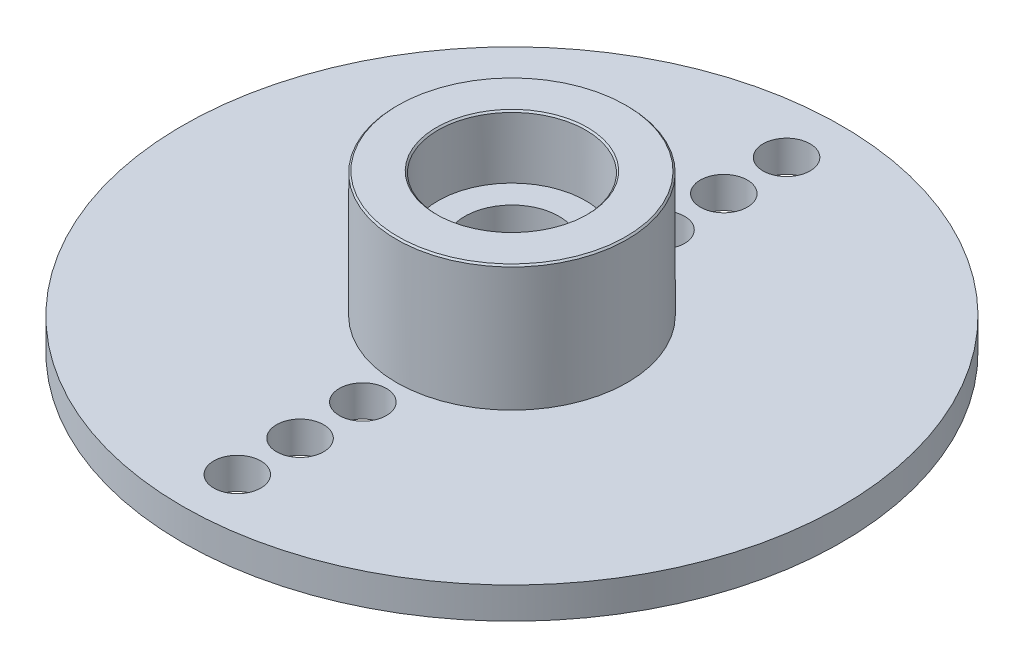
ISO-10303-21;
HEADER;
FILE_DESCRIPTION(('STEP AP214'),'2;1');
FILE_NAME('part.step','',(''),(''),'','','');
FILE_SCHEMA(('AUTOMOTIVE_DESIGN { 1 0 10303 214 1 1 1 1 }'));
ENDSEC;
DATA;
#1=APPLICATION_CONTEXT('core data for automotive mechanical design processes');
#2=APPLICATION_PROTOCOL_DEFINITION('international standard','automotive_design',2000,#1);
#3=PRODUCT_CONTEXT('',#1,'mechanical');
#4=PRODUCT('Part','Part','',(#3));
#5=PRODUCT_RELATED_PRODUCT_CATEGORY('part','',(#4));
#6=PRODUCT_DEFINITION_FORMATION('','',#4);
#7=PRODUCT_DEFINITION_CONTEXT('part definition',#1,'design');
#8=PRODUCT_DEFINITION('design','',#6,#7);
#9=PRODUCT_DEFINITION_SHAPE('','',#8);
#10=(LENGTH_UNIT() NAMED_UNIT(*) SI_UNIT(.MILLI.,.METRE.));
#11=(NAMED_UNIT(*) PLANE_ANGLE_UNIT() SI_UNIT($,.RADIAN.));
#12=(NAMED_UNIT(*) SI_UNIT($,.STERADIAN.) SOLID_ANGLE_UNIT());
#13=UNCERTAINTY_MEASURE_WITH_UNIT(LENGTH_MEASURE(1.E-05),#10,'distance_accuracy_value','');
#14=(GEOMETRIC_REPRESENTATION_CONTEXT(3) GLOBAL_UNCERTAINTY_ASSIGNED_CONTEXT((#13)) GLOBAL_UNIT_ASSIGNED_CONTEXT((#10,
#11,#12)) REPRESENTATION_CONTEXT('',''));
#15=CARTESIAN_POINT('',(0.,0.,0.));
#16=DIRECTION('',(0.,0.,1.));
#17=DIRECTION('',(1.,0.,0.));
#18=AXIS2_PLACEMENT_3D('',#15,#16,#17);
#19=CARTESIAN_POINT('',(0.,5.,0.));
#20=DIRECTION('',(0.,-1.,0.));
#21=DIRECTION('',(0.,0.,-1.));
#22=AXIS2_PLACEMENT_3D('',#19,#20,#21);
#23=CYLINDRICAL_SURFACE('',#22,1.5);
#24=CARTESIAN_POINT('',(0.,1.,0.));
#25=DIRECTION('',(0.,1.,0.));
#26=DIRECTION('',(0.,0.,1.));
#27=AXIS2_PLACEMENT_3D('',#24,#25,#26);
#28=CIRCLE('',#27,1.5);
#29=CARTESIAN_POINT('',(0.,1.,1.5));
#30=VERTEX_POINT('',#29);
#31=EDGE_CURVE('E109',#30,#30,#28,.T.);
#32=ORIENTED_EDGE('',*,*,#31,.F.);
#33=EDGE_LOOP('',(#32));
#34=FACE_BOUND('',#33,.T.);
#35=CARTESIAN_POINT('',(0.,3.,0.));
#36=DIRECTION('',(0.,1.,0.));
#37=DIRECTION('',(0.,0.,1.));
#38=AXIS2_PLACEMENT_3D('',#35,#36,#37);
#39=CIRCLE('',#38,1.5);
#40=CARTESIAN_POINT('',(0.,3.,1.5));
#41=VERTEX_POINT('',#40);
#42=EDGE_CURVE('E70',#41,#41,#39,.F.);
#43=ORIENTED_EDGE('',*,*,#42,.F.);
#44=EDGE_LOOP('',(#43));
#45=FACE_BOUND('',#44,.T.);
#46=ADVANCED_FACE('F45',(#34,#45),#23,.F.);
#47=CARTESIAN_POINT('',(0.,1.,0.));
#48=DIRECTION('',(0.,1.,0.));
#49=DIRECTION('',(0.,0.,1.));
#50=AXIS2_PLACEMENT_3D('',#47,#48,#49);
#51=PLANE('',#50);
#52=CARTESIAN_POINT('',(0.,1.,0.));
#53=DIRECTION('',(0.,1.,0.));
#54=DIRECTION('',(0.,0.,1.));
#55=AXIS2_PLACEMENT_3D('',#52,#53,#54);
#56=CIRCLE('',#55,0.75);
#57=CARTESIAN_POINT('',(0.,1.,0.75));
#58=VERTEX_POINT('',#57);
#59=EDGE_CURVE('E79',#58,#58,#56,.F.);
#60=ORIENTED_EDGE('',*,*,#59,.T.);
#61=EDGE_LOOP('',(#60));
#62=FACE_BOUND('',#61,.T.);
#63=ORIENTED_EDGE('',*,*,#31,.T.);
#64=EDGE_LOOP('',(#63));
#65=FACE_BOUND('',#64,.T.);
#66=ADVANCED_FACE('F174',(#62,#65),#51,.T.);
#67=CARTESIAN_POINT('',(1.11016832917263E-13,1.,6.74999999999998));
#68=DIRECTION('',(0.,-1.,0.));
#69=DIRECTION('',(0.,0.,-1.));
#70=AXIS2_PLACEMENT_3D('',#67,#68,#69);
#71=CYLINDRICAL_SURFACE('',#70,0.75);
#72=CARTESIAN_POINT('',(1.11016832917263E-13,1.,6.74999999999998));
#73=DIRECTION('',(0.,1.,0.));
#74=DIRECTION('',(0.,0.,1.));
#75=AXIS2_PLACEMENT_3D('',#72,#73,#74);
#76=CIRCLE('',#75,0.75);
#77=CARTESIAN_POINT('',(1.11016832917263E-13,1.,7.49999999999998));
#78=VERTEX_POINT('',#77);
#79=EDGE_CURVE('E114',#78,#78,#76,.F.);
#80=ORIENTED_EDGE('',*,*,#79,.F.);
#81=EDGE_LOOP('',(#80));
#82=FACE_BOUND('',#81,.T.);
#83=CARTESIAN_POINT('',(1.11016832917263E-13,0.,6.74999999999998));
#84=DIRECTION('',(0.,1.,0.));
#85=DIRECTION('',(0.,0.,1.));
#86=AXIS2_PLACEMENT_3D('',#83,#84,#85);
#87=CIRCLE('',#86,0.75);
#88=CARTESIAN_POINT('',(1.11016832917263E-13,0.,7.49999999999998));
#89=VERTEX_POINT('',#88);
#90=EDGE_CURVE('E85',#89,#89,#87,.F.);
#91=ORIENTED_EDGE('',*,*,#90,.T.);
#92=EDGE_LOOP('',(#91));
#93=FACE_BOUND('',#92,.T.);
#94=ADVANCED_FACE('F180',(#82,#93),#71,.F.);
#95=CARTESIAN_POINT('',(0.,1.,-8.74999999999998));
#96=DIRECTION('',(0.,-1.,0.));
#97=DIRECTION('',(0.,0.,-1.));
#98=AXIS2_PLACEMENT_3D('',#95,#96,#97);
#99=CYLINDRICAL_SURFACE('',#98,0.75);
#100=CARTESIAN_POINT('',(0.,1.,-8.74999999999998));
#101=DIRECTION('',(0.,1.,0.));
#102=DIRECTION('',(0.,0.,1.));
#103=AXIS2_PLACEMENT_3D('',#100,#101,#102);
#104=CIRCLE('',#103,0.75);
#105=CARTESIAN_POINT('',(0.,1.,-7.99999999999998));
#106=VERTEX_POINT('',#105);
#107=EDGE_CURVE('E118',#106,#106,#104,.T.);
#108=ORIENTED_EDGE('',*,*,#107,.T.);
#109=EDGE_LOOP('',(#108));
#110=FACE_BOUND('',#109,.T.);
#111=CARTESIAN_POINT('',(0.,0.,-8.74999999999998));
#112=DIRECTION('',(0.,1.,0.));
#113=DIRECTION('',(0.,0.,1.));
#114=AXIS2_PLACEMENT_3D('',#111,#112,#113);
#115=CIRCLE('',#114,0.75);
#116=CARTESIAN_POINT('',(0.,0.,-7.99999999999998));
#117=VERTEX_POINT('',#116);
#118=EDGE_CURVE('E89',#117,#117,#115,.T.);
#119=ORIENTED_EDGE('',*,*,#118,.F.);
#120=EDGE_LOOP('',(#119));
#121=FACE_BOUND('',#120,.T.);
#122=ADVANCED_FACE('F210',(#110,#121),#99,.F.);
#123=CARTESIAN_POINT('',(1.11016832917263E-13,1.,-6.74999999999998));
#124=DIRECTION('',(0.,-1.,0.));
#125=DIRECTION('',(0.,0.,-1.));
#126=AXIS2_PLACEMENT_3D('',#123,#124,#125);
#127=CYLINDRICAL_SURFACE('',#126,0.75);
#128=CARTESIAN_POINT('',(1.11016832917263E-13,1.,-6.74999999999998));
#129=DIRECTION('',(0.,1.,0.));
#130=DIRECTION('',(0.,0.,1.));
#131=AXIS2_PLACEMENT_3D('',#128,#129,#130);
#132=CIRCLE('',#131,0.75);
#133=CARTESIAN_POINT('',(1.11016832917263E-13,1.,-5.99999999999998));
#134=VERTEX_POINT('',#133);
#135=EDGE_CURVE('E122',#134,#134,#132,.T.);
#136=ORIENTED_EDGE('',*,*,#135,.T.);
#137=EDGE_LOOP('',(#136));
#138=FACE_BOUND('',#137,.T.);
#139=CARTESIAN_POINT('',(1.11016832917263E-13,0.,-6.74999999999998));
#140=DIRECTION('',(0.,1.,0.));
#141=DIRECTION('',(0.,0.,1.));
#142=AXIS2_PLACEMENT_3D('',#139,#140,#141);
#143=CIRCLE('',#142,0.75);
#144=CARTESIAN_POINT('',(1.11016832917263E-13,0.,-5.99999999999998));
#145=VERTEX_POINT('',#144);
#146=EDGE_CURVE('E93',#145,#145,#143,.T.);
#147=ORIENTED_EDGE('',*,*,#146,.F.);
#148=EDGE_LOOP('',(#147));
#149=FACE_BOUND('',#148,.T.);
#150=ADVANCED_FACE('F214',(#138,#149),#127,.F.);
#151=CARTESIAN_POINT('',(1.35518434629123E-13,1.,-4.74999999999998));
#152=DIRECTION('',(0.,-1.,0.));
#153=DIRECTION('',(0.,0.,-1.));
#154=AXIS2_PLACEMENT_3D('',#151,#152,#153);
#155=CYLINDRICAL_SURFACE('',#154,0.75);
#156=CARTESIAN_POINT('',(1.35518434629123E-13,1.,-4.74999999999998));
#157=DIRECTION('',(0.,1.,0.));
#158=DIRECTION('',(0.,0.,1.));
#159=AXIS2_PLACEMENT_3D('',#156,#157,#158);
#160=CIRCLE('',#159,0.75);
#161=CARTESIAN_POINT('',(1.35518434629123E-13,1.,-3.99999999999998));
#162=VERTEX_POINT('',#161);
#163=EDGE_CURVE('E126',#162,#162,#160,.T.);
#164=ORIENTED_EDGE('',*,*,#163,.T.);
#165=EDGE_LOOP('',(#164));
#166=FACE_BOUND('',#165,.T.);
#167=CARTESIAN_POINT('',(1.35518434629123E-13,0.,-4.74999999999998));
#168=DIRECTION('',(0.,1.,0.));
#169=DIRECTION('',(0.,0.,1.));
#170=AXIS2_PLACEMENT_3D('',#167,#168,#169);
#171=CIRCLE('',#170,0.75);
#172=CARTESIAN_POINT('',(1.35518434629123E-13,0.,-3.99999999999998));
#173=VERTEX_POINT('',#172);
#174=EDGE_CURVE('E97',#173,#173,#171,.T.);
#175=ORIENTED_EDGE('',*,*,#174,.F.);
#176=EDGE_LOOP('',(#175));
#177=FACE_BOUND('',#176,.T.);
#178=ADVANCED_FACE('F218',(#166,#177),#155,.F.);
#179=CARTESIAN_POINT('',(1.35518434629123E-13,1.,4.74999999999998));
#180=DIRECTION('',(0.,-1.,0.));
#181=DIRECTION('',(0.,0.,-1.));
#182=AXIS2_PLACEMENT_3D('',#179,#180,#181);
#183=CYLINDRICAL_SURFACE('',#182,0.75);
#184=CARTESIAN_POINT('',(1.35518434629123E-13,1.,4.74999999999998));
#185=DIRECTION('',(0.,1.,0.));
#186=DIRECTION('',(0.,0.,1.));
#187=AXIS2_PLACEMENT_3D('',#184,#185,#186);
#188=CIRCLE('',#187,0.75);
#189=CARTESIAN_POINT('',(1.35518434629123E-13,1.,5.49999999999998));
#190=VERTEX_POINT('',#189);
#191=EDGE_CURVE('E130',#190,#190,#188,.F.);
#192=ORIENTED_EDGE('',*,*,#191,.F.);
#193=EDGE_LOOP('',(#192));
#194=FACE_BOUND('',#193,.T.);
#195=CARTESIAN_POINT('',(1.35518434629123E-13,0.,4.74999999999998));
#196=DIRECTION('',(0.,1.,0.));
#197=DIRECTION('',(0.,0.,1.));
#198=AXIS2_PLACEMENT_3D('',#195,#196,#197);
#199=CIRCLE('',#198,0.75);
#200=CARTESIAN_POINT('',(1.35518434629123E-13,0.,5.49999999999998));
#201=VERTEX_POINT('',#200);
#202=EDGE_CURVE('E101',#201,#201,#199,.F.);
#203=ORIENTED_EDGE('',*,*,#202,.T.);
#204=EDGE_LOOP('',(#203));
#205=FACE_BOUND('',#204,.T.);
#206=ADVANCED_FACE('F222',(#194,#205),#183,.F.);
#207=CARTESIAN_POINT('',(0.,1.,8.74999999999998));
#208=DIRECTION('',(0.,-1.,0.));
#209=DIRECTION('',(0.,0.,-1.));
#210=AXIS2_PLACEMENT_3D('',#207,#208,#209);
#211=CYLINDRICAL_SURFACE('',#210,0.75);
#212=CARTESIAN_POINT('',(0.,1.,8.74999999999998));
#213=DIRECTION('',(0.,1.,0.));
#214=DIRECTION('',(0.,0.,1.));
#215=AXIS2_PLACEMENT_3D('',#212,#213,#214);
#216=CIRCLE('',#215,0.75);
#217=CARTESIAN_POINT('',(0.,1.,9.49999999999998));
#218=VERTEX_POINT('',#217);
#219=EDGE_CURVE('E84',#218,#218,#216,.F.);
#220=ORIENTED_EDGE('',*,*,#219,.F.);
#221=EDGE_LOOP('',(#220));
#222=FACE_BOUND('',#221,.T.);
#223=CARTESIAN_POINT('',(0.,0.,8.74999999999998));
#224=DIRECTION('',(0.,1.,0.));
#225=DIRECTION('',(0.,0.,1.));
#226=AXIS2_PLACEMENT_3D('',#223,#224,#225);
#227=CIRCLE('',#226,0.75);
#228=CARTESIAN_POINT('',(0.,0.,9.49999999999998));
#229=VERTEX_POINT('',#228);
#230=EDGE_CURVE('E105',#229,#229,#227,.F.);
#231=ORIENTED_EDGE('',*,*,#230,.T.);
#232=EDGE_LOOP('',(#231));
#233=FACE_BOUND('',#232,.T.);
#234=ADVANCED_FACE('F206',(#222,#233),#211,.F.);
#235=CARTESIAN_POINT('',(0.,1.,0.));
#236=DIRECTION('',(0.,-1.,0.));
#237=DIRECTION('',(0.,0.,-1.));
#238=AXIS2_PLACEMENT_3D('',#235,#236,#237);
#239=CYLINDRICAL_SURFACE('',#238,10.5);
#240=CARTESIAN_POINT('',(0.,1.,0.));
#241=DIRECTION('',(0.,1.,0.));
#242=DIRECTION('',(0.,0.,1.));
#243=AXIS2_PLACEMENT_3D('',#240,#241,#242);
#244=CIRCLE('',#243,10.5);
#245=CARTESIAN_POINT('',(0.,1.,10.5));
#246=VERTEX_POINT('',#245);
#247=EDGE_CURVE('E110',#246,#246,#244,.T.);
#248=ORIENTED_EDGE('',*,*,#247,.F.);
#249=EDGE_LOOP('',(#248));
#250=FACE_BOUND('',#249,.T.);
#251=CARTESIAN_POINT('',(0.,0.,0.));
#252=DIRECTION('',(0.,1.,0.));
#253=DIRECTION('',(0.,0.,1.));
#254=AXIS2_PLACEMENT_3D('',#251,#252,#253);
#255=CIRCLE('',#254,10.5);
#256=CARTESIAN_POINT('',(0.,0.,10.5));
#257=VERTEX_POINT('',#256);
#258=EDGE_CURVE('E80',#257,#257,#255,.T.);
#259=ORIENTED_EDGE('',*,*,#258,.T.);
#260=EDGE_LOOP('',(#259));
#261=FACE_BOUND('',#260,.T.);
#262=ADVANCED_FACE('F199',(#250,#261),#239,.T.);
#263=CARTESIAN_POINT('',(0.,1.,0.));
#264=DIRECTION('',(0.,1.,0.));
#265=DIRECTION('',(0.,0.,1.));
#266=AXIS2_PLACEMENT_3D('',#263,#264,#265);
#267=CIRCLE('',#266,3.67931811974818);
#268=CARTESIAN_POINT('',(0.,1.,3.67931811974818));
#269=VERTEX_POINT('',#268);
#270=EDGE_CURVE('E69',#269,#269,#267,.T.);
#271=ORIENTED_EDGE('',*,*,#270,.F.);
#272=EDGE_LOOP('',(#271));
#273=FACE_BOUND('',#272,.T.);
#274=ORIENTED_EDGE('',*,*,#219,.T.);
#275=EDGE_LOOP('',(#274));
#276=FACE_BOUND('',#275,.T.);
#277=ORIENTED_EDGE('',*,*,#191,.T.);
#278=EDGE_LOOP('',(#277));
#279=FACE_BOUND('',#278,.T.);
#280=ORIENTED_EDGE('',*,*,#163,.F.);
#281=EDGE_LOOP('',(#280));
#282=FACE_BOUND('',#281,.T.);
#283=ORIENTED_EDGE('',*,*,#135,.F.);
#284=EDGE_LOOP('',(#283));
#285=FACE_BOUND('',#284,.T.);
#286=ORIENTED_EDGE('',*,*,#107,.F.);
#287=EDGE_LOOP('',(#286));
#288=FACE_BOUND('',#287,.T.);
#289=ORIENTED_EDGE('',*,*,#79,.T.);
#290=EDGE_LOOP('',(#289));
#291=FACE_BOUND('',#290,.T.);
#292=ORIENTED_EDGE('',*,*,#247,.T.);
#293=EDGE_LOOP('',(#292));
#294=FACE_BOUND('',#293,.T.);
#295=ADVANCED_FACE('F183',(#273,#276,#279,#282,#285,#288,#291,#294),#51,.T.);
#296=CARTESIAN_POINT('',(0.,0.,0.));
#297=DIRECTION('',(0.,1.,0.));
#298=DIRECTION('',(0.,0.,1.));
#299=AXIS2_PLACEMENT_3D('',#296,#297,#298);
#300=PLANE('',#299);
#301=CARTESIAN_POINT('',(0.,0.,0.));
#302=DIRECTION('',(0.,-1.,0.));
#303=DIRECTION('',(0.,0.,-1.));
#304=AXIS2_PLACEMENT_3D('',#301,#302,#303);
#305=CIRCLE('',#304,1.5);
#306=CARTESIAN_POINT('',(0.,0.,-1.5));
#307=VERTEX_POINT('',#306);
#308=EDGE_CURVE('E144',#307,#307,#305,.T.);
#309=ORIENTED_EDGE('',*,*,#308,.F.);
#310=EDGE_LOOP('',(#309));
#311=FACE_BOUND('',#310,.T.);
#312=ORIENTED_EDGE('',*,*,#230,.F.);
#313=EDGE_LOOP('',(#312));
#314=FACE_BOUND('',#313,.T.);
#315=ORIENTED_EDGE('',*,*,#202,.F.);
#316=EDGE_LOOP('',(#315));
#317=FACE_BOUND('',#316,.T.);
#318=ORIENTED_EDGE('',*,*,#174,.T.);
#319=EDGE_LOOP('',(#318));
#320=FACE_BOUND('',#319,.T.);
#321=ORIENTED_EDGE('',*,*,#146,.T.);
#322=EDGE_LOOP('',(#321));
#323=FACE_BOUND('',#322,.T.);
#324=ORIENTED_EDGE('',*,*,#118,.T.);
#325=EDGE_LOOP('',(#324));
#326=FACE_BOUND('',#325,.T.);
#327=ORIENTED_EDGE('',*,*,#90,.F.);
#328=EDGE_LOOP('',(#327));
#329=FACE_BOUND('',#328,.T.);
#330=ORIENTED_EDGE('',*,*,#258,.F.);
#331=EDGE_LOOP('',(#330));
#332=FACE_BOUND('',#331,.T.);
#333=ADVANCED_FACE('F195',(#311,#314,#317,#320,#323,#326,#329,#332),#300,.F.);
#334=CARTESIAN_POINT('',(0.,5.,0.));
#335=DIRECTION('',(0.,-1.,0.));
#336=DIRECTION('',(0.,0.,-1.));
#337=AXIS2_PLACEMENT_3D('',#334,#335,#336);
#338=CYLINDRICAL_SURFACE('',#337,3.67931811974818);
#339=CARTESIAN_POINT('',(0.,4.95,0.));
#340=DIRECTION('',(0.,-1.,0.));
#341=DIRECTION('',(0.,0.,-1.));
#342=AXIS2_PLACEMENT_3D('',#339,#340,#341);
#343=CIRCLE('',#342,3.67931811974818);
#344=CARTESIAN_POINT('',(0.,4.95,-3.67931811974818));
#345=VERTEX_POINT('',#344);
#346=EDGE_CURVE('E63',#345,#345,#343,.T.);
#347=ORIENTED_EDGE('',*,*,#346,.T.);
#348=EDGE_LOOP('',(#347));
#349=FACE_BOUND('',#348,.T.);
#350=ORIENTED_EDGE('',*,*,#270,.T.);
#351=EDGE_LOOP('',(#350));
#352=FACE_BOUND('',#351,.T.);
#353=ADVANCED_FACE('F193',(#349,#352),#338,.T.);
#354=CARTESIAN_POINT('',(0.,5.,0.));
#355=DIRECTION('',(0.,-1.,0.));
#356=DIRECTION('',(0.,0.,-1.));
#357=AXIS2_PLACEMENT_3D('',#354,#355,#356);
#358=PLANE('',#357);
#359=CARTESIAN_POINT('',(0.,5.,0.));
#360=DIRECTION('',(0.,-1.,0.));
#361=DIRECTION('',(0.,0.,-1.));
#362=AXIS2_PLACEMENT_3D('',#359,#360,#361);
#363=CIRCLE('',#362,3.62931811974818);
#364=CARTESIAN_POINT('',(0.,5.,-3.62931811974818));
#365=VERTEX_POINT('',#364);
#366=EDGE_CURVE('E53',#365,#365,#363,.F.);
#367=ORIENTED_EDGE('',*,*,#366,.T.);
#368=EDGE_LOOP('',(#367));
#369=FACE_BOUND('',#368,.T.);
#370=CARTESIAN_POINT('',(0.,5.,0.));
#371=DIRECTION('',(0.,-1.,0.));
#372=DIRECTION('',(0.,0.,-1.));
#373=AXIS2_PLACEMENT_3D('',#370,#371,#372);
#374=CIRCLE('',#373,2.405);
#375=CARTESIAN_POINT('',(0.,5.,-2.405));
#376=VERTEX_POINT('',#375);
#377=EDGE_CURVE('E58',#376,#376,#374,.T.);
#378=ORIENTED_EDGE('',*,*,#377,.T.);
#379=EDGE_LOOP('',(#378));
#380=FACE_BOUND('',#379,.T.);
#381=ADVANCED_FACE('F190',(#369,#380),#358,.F.);
#382=CARTESIAN_POINT('',(0.,0.5,0.));
#383=DIRECTION('',(0.,-1.,0.));
#384=DIRECTION('',(0.,0.,-1.));
#385=AXIS2_PLACEMENT_3D('',#382,#383,#384);
#386=CYLINDRICAL_SURFACE('',#385,1.5);
#387=CARTESIAN_POINT('',(0.,0.5,0.));
#388=DIRECTION('',(0.,-1.,0.));
#389=DIRECTION('',(0.,0.,-1.));
#390=AXIS2_PLACEMENT_3D('',#387,#388,#389);
#391=CIRCLE('',#390,1.5);
#392=CARTESIAN_POINT('',(0.,0.5,-1.5));
#393=VERTEX_POINT('',#392);
#394=EDGE_CURVE('E143',#393,#393,#391,.T.);
#395=ORIENTED_EDGE('',*,*,#394,.F.);
#396=EDGE_LOOP('',(#395));
#397=FACE_BOUND('',#396,.T.);
#398=ORIENTED_EDGE('',*,*,#308,.T.);
#399=EDGE_LOOP('',(#398));
#400=FACE_BOUND('',#399,.T.);
#401=ADVANCED_FACE('F188',(#397,#400),#386,.F.);
#402=CARTESIAN_POINT('',(0.,0.5,0.));
#403=DIRECTION('',(0.,-1.,0.));
#404=DIRECTION('',(0.,0.,-1.));
#405=AXIS2_PLACEMENT_3D('',#402,#403,#404);
#406=PLANE('',#405);
#407=CARTESIAN_POINT('',(0.,0.5,0.));
#408=DIRECTION('',(0.,-1.,0.));
#409=DIRECTION('',(0.,0.,-1.));
#410=AXIS2_PLACEMENT_3D('',#407,#408,#409);
#411=CIRCLE('',#410,0.75);
#412=CARTESIAN_POINT('',(0.,0.5,-0.75));
#413=VERTEX_POINT('',#412);
#414=EDGE_CURVE('E74',#413,#413,#411,.F.);
#415=ORIENTED_EDGE('',*,*,#414,.T.);
#416=EDGE_LOOP('',(#415));
#417=FACE_BOUND('',#416,.T.);
#418=ORIENTED_EDGE('',*,*,#394,.T.);
#419=EDGE_LOOP('',(#418));
#420=FACE_BOUND('',#419,.T.);
#421=ADVANCED_FACE('F295',(#417,#420),#406,.T.);
#422=CARTESIAN_POINT('',(0.,5.,0.));
#423=DIRECTION('',(0.,-1.,0.));
#424=DIRECTION('',(0.,0.,-1.));
#425=AXIS2_PLACEMENT_3D('',#422,#423,#424);
#426=CYLINDRICAL_SURFACE('',#425,0.75);
#427=ORIENTED_EDGE('',*,*,#59,.F.);
#428=EDGE_LOOP('',(#427));
#429=FACE_BOUND('',#428,.T.);
#430=ORIENTED_EDGE('',*,*,#414,.F.);
#431=EDGE_LOOP('',(#430));
#432=FACE_BOUND('',#431,.T.);
#433=ADVANCED_FACE('F170',(#429,#432),#426,.F.);
#434=CARTESIAN_POINT('',(0.,3.,0.));
#435=DIRECTION('',(0.,1.,0.));
#436=DIRECTION('',(0.,0.,1.));
#437=AXIS2_PLACEMENT_3D('',#434,#435,#436);
#438=PLANE('',#437);
#439=CARTESIAN_POINT('',(0.,3.,0.));
#440=DIRECTION('',(0.,1.,0.));
#441=DIRECTION('',(0.,0.,1.));
#442=AXIS2_PLACEMENT_3D('',#439,#440,#441);
#443=CIRCLE('',#442,2.355);
#444=CARTESIAN_POINT('',(0.,3.,2.355));
#445=VERTEX_POINT('',#444);
#446=EDGE_CURVE('E75',#445,#445,#443,.T.);
#447=ORIENTED_EDGE('',*,*,#446,.T.);
#448=EDGE_LOOP('',(#447));
#449=FACE_BOUND('',#448,.T.);
#450=ORIENTED_EDGE('',*,*,#42,.T.);
#451=EDGE_LOOP('',(#450));
#452=FACE_BOUND('',#451,.T.);
#453=ADVANCED_FACE('F158',(#449,#452),#438,.T.);
#454=CARTESIAN_POINT('',(0.,3.,0.));
#455=DIRECTION('',(0.,1.,0.));
#456=DIRECTION('',(0.,0.,1.));
#457=AXIS2_PLACEMENT_3D('',#454,#455,#456);
#458=CYLINDRICAL_SURFACE('',#457,2.355);
#459=CARTESIAN_POINT('',(0.,4.95,0.));
#460=DIRECTION('',(0.,-1.,0.));
#461=DIRECTION('',(0.,0.,-1.));
#462=AXIS2_PLACEMENT_3D('',#459,#460,#461);
#463=CIRCLE('',#462,2.355);
#464=CARTESIAN_POINT('',(0.,4.95,-2.355));
#465=VERTEX_POINT('',#464);
#466=EDGE_CURVE('E11',#465,#465,#463,.F.);
#467=ORIENTED_EDGE('',*,*,#466,.T.);
#468=EDGE_LOOP('',(#467));
#469=FACE_BOUND('',#468,.T.);
#470=ORIENTED_EDGE('',*,*,#446,.F.);
#471=EDGE_LOOP('',(#470));
#472=FACE_BOUND('',#471,.T.);
#473=ADVANCED_FACE('F161',(#469,#472),#458,.F.);
#474=CARTESIAN_POINT('',(0.,4.95,0.));
#475=DIRECTION('',(0.,-1.,0.));
#476=DIRECTION('',(0.,0.,-1.));
#477=AXIS2_PLACEMENT_3D('',#474,#475,#476);
#478=CONICAL_SURFACE('',#477,3.67931811974818,0.785398163397457);
#479=ORIENTED_EDGE('',*,*,#366,.F.);
#480=EDGE_LOOP('',(#479));
#481=FACE_BOUND('',#480,.T.);
#482=ORIENTED_EDGE('',*,*,#346,.F.);
#483=EDGE_LOOP('',(#482));
#484=FACE_BOUND('',#483,.T.);
#485=ADVANCED_FACE('F163',(#481,#484),#478,.T.);
#486=CARTESIAN_POINT('',(0.,4.95,0.));
#487=DIRECTION('',(0.,1.,0.));
#488=DIRECTION('',(0.,0.,1.));
#489=AXIS2_PLACEMENT_3D('',#486,#487,#488);
#490=CONICAL_SURFACE('',#489,2.355,0.785398163397461);
#491=ORIENTED_EDGE('',*,*,#377,.F.);
#492=EDGE_LOOP('',(#491));
#493=FACE_BOUND('',#492,.T.);
#494=ORIENTED_EDGE('',*,*,#466,.F.);
#495=EDGE_LOOP('',(#494));
#496=FACE_BOUND('',#495,.T.);
#497=ADVANCED_FACE('F47',(#493,#496),#490,.F.);
#498=CLOSED_SHELL('',(#46,#66,#94,#122,#150,#178,#206,#234,#262,#295,#333,#353,#381,#401,#421,
#433,#453,#473,#485,#497));
#499=MANIFOLD_SOLID_BREP('B2',#498);
#500=ADVANCED_BREP_SHAPE_REPRESENTATION('',(#18,#499),#14);
#501=SHAPE_DEFINITION_REPRESENTATION(#9,#500);
ENDSEC;
END-ISO-10303-21;
